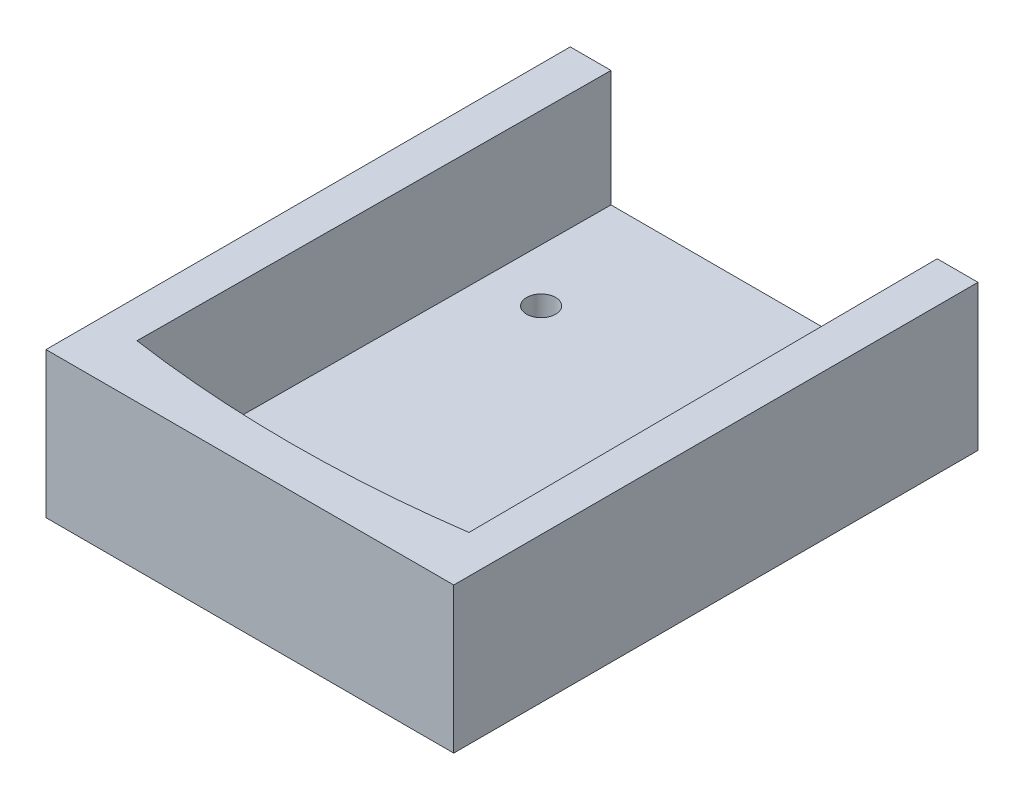
ISO-10303-21;
HEADER;
FILE_DESCRIPTION(('STEP AP214'),'2;1');
FILE_NAME('part.step','',(''),(''),'','','');
FILE_SCHEMA(('AUTOMOTIVE_DESIGN { 1 0 10303 214 1 1 1 1 }'));
ENDSEC;
DATA;
#1=APPLICATION_CONTEXT('core data for automotive mechanical design processes');
#2=APPLICATION_PROTOCOL_DEFINITION('international standard','automotive_design',2000,#1);
#3=PRODUCT_CONTEXT('',#1,'mechanical');
#4=PRODUCT('Part','Part','',(#3));
#5=PRODUCT_RELATED_PRODUCT_CATEGORY('part','',(#4));
#6=PRODUCT_DEFINITION_FORMATION('','',#4);
#7=PRODUCT_DEFINITION_CONTEXT('part definition',#1,'design');
#8=PRODUCT_DEFINITION('design','',#6,#7);
#9=PRODUCT_DEFINITION_SHAPE('','',#8);
#10=(LENGTH_UNIT() NAMED_UNIT(*) SI_UNIT(.MILLI.,.METRE.));
#11=(NAMED_UNIT(*) PLANE_ANGLE_UNIT() SI_UNIT($,.RADIAN.));
#12=(NAMED_UNIT(*) SI_UNIT($,.STERADIAN.) SOLID_ANGLE_UNIT());
#13=UNCERTAINTY_MEASURE_WITH_UNIT(LENGTH_MEASURE(1.E-05),#10,'distance_accuracy_value','');
#14=(GEOMETRIC_REPRESENTATION_CONTEXT(3) GLOBAL_UNCERTAINTY_ASSIGNED_CONTEXT((#13)) GLOBAL_UNIT_ASSIGNED_CONTEXT((#10,
#11,#12)) REPRESENTATION_CONTEXT('',''));
#15=CARTESIAN_POINT('',(0.,0.,0.));
#16=DIRECTION('',(0.,0.,1.));
#17=DIRECTION('',(1.,0.,0.));
#18=AXIS2_PLACEMENT_3D('',#15,#16,#17);
#19=CARTESIAN_POINT('',(70.,25.,0.));
#20=DIRECTION('',(0.,0.,-1.));
#21=DIRECTION('',(-1.,0.,0.));
#22=AXIS2_PLACEMENT_3D('',#19,#20,#21);
#23=PLANE('',#22);
#24=DIRECTION('',(1.,0.,0.));
#25=VECTOR('',#24,1.);
#26=CARTESIAN_POINT('',(70.,0.,0.));
#27=LINE('',#26,#25);
#28=CARTESIAN_POINT('',(0.,0.,0.));
#29=VERTEX_POINT('',#28);
#30=CARTESIAN_POINT('',(70.,0.,0.));
#31=VERTEX_POINT('',#30);
#32=EDGE_CURVE('E149',#29,#31,#27,.T.);
#33=ORIENTED_EDGE('',*,*,#32,.T.);
#34=DIRECTION('',(0.,-1.,0.));
#35=VECTOR('',#34,1.);
#36=CARTESIAN_POINT('',(70.,25.,0.));
#37=LINE('',#36,#35);
#38=CARTESIAN_POINT('',(70.,25.,0.));
#39=VERTEX_POINT('',#38);
#40=EDGE_CURVE('E12',#39,#31,#37,.T.);
#41=ORIENTED_EDGE('',*,*,#40,.F.);
#42=DIRECTION('',(1.,0.,0.));
#43=VECTOR('',#42,1.);
#44=CARTESIAN_POINT('',(70.,25.,0.));
#45=LINE('',#44,#43);
#46=CARTESIAN_POINT('',(0.,25.,0.));
#47=VERTEX_POINT('',#46);
#48=EDGE_CURVE('E153',#47,#39,#45,.T.);
#49=ORIENTED_EDGE('',*,*,#48,.F.);
#50=DIRECTION('',(0.,-1.,0.));
#51=VECTOR('',#50,1.);
#52=CARTESIAN_POINT('',(0.,25.,0.));
#53=LINE('',#52,#51);
#54=EDGE_CURVE('E161',#47,#29,#53,.T.);
#55=ORIENTED_EDGE('',*,*,#54,.T.);
#56=EDGE_LOOP('',(#33,#41,#49,#55));
#57=FACE_BOUND('',#56,.T.);
#58=ADVANCED_FACE('F41',(#57),#23,.F.);
#59=CARTESIAN_POINT('',(70.,25.,-90.));
#60=DIRECTION('',(-1.,0.,0.));
#61=DIRECTION('',(0.,0.,1.));
#62=AXIS2_PLACEMENT_3D('',#59,#60,#61);
#63=PLANE('',#62);
#64=DIRECTION('',(0.,0.,-1.));
#65=VECTOR('',#64,1.);
#66=CARTESIAN_POINT('',(70.,0.,-90.));
#67=LINE('',#66,#65);
#68=CARTESIAN_POINT('',(70.,0.,-90.));
#69=VERTEX_POINT('',#68);
#70=EDGE_CURVE('E164',#31,#69,#67,.T.);
#71=ORIENTED_EDGE('',*,*,#70,.T.);
#72=DIRECTION('',(0.,-1.,0.));
#73=VECTOR('',#72,1.);
#74=CARTESIAN_POINT('',(70.,25.,-90.));
#75=LINE('',#74,#73);
#76=CARTESIAN_POINT('',(70.,25.,-90.));
#77=VERTEX_POINT('',#76);
#78=EDGE_CURVE('E48',#77,#69,#75,.T.);
#79=ORIENTED_EDGE('',*,*,#78,.F.);
#80=DIRECTION('',(0.,0.,-1.));
#81=VECTOR('',#80,1.);
#82=CARTESIAN_POINT('',(70.,25.,-90.));
#83=LINE('',#82,#81);
#84=EDGE_CURVE('E92',#39,#77,#83,.T.);
#85=ORIENTED_EDGE('',*,*,#84,.F.);
#86=ORIENTED_EDGE('',*,*,#40,.T.);
#87=EDGE_LOOP('',(#71,#79,#85,#86));
#88=FACE_BOUND('',#87,.T.);
#89=ADVANCED_FACE('F200',(#88),#63,.F.);
#90=CARTESIAN_POINT('',(0.,25.,-90.));
#91=DIRECTION('',(0.,0.,1.));
#92=DIRECTION('',(1.,0.,0.));
#93=AXIS2_PLACEMENT_3D('',#90,#91,#92);
#94=PLANE('',#93);
#95=DIRECTION('',(-1.,0.,0.));
#96=VECTOR('',#95,1.);
#97=CARTESIAN_POINT('',(0.,25.,-90.));
#98=LINE('',#97,#96);
#99=CARTESIAN_POINT('',(7.,25.,-90.));
#100=VERTEX_POINT('',#99);
#101=CARTESIAN_POINT('',(0.,25.,-90.));
#102=VERTEX_POINT('',#101);
#103=EDGE_CURVE('E156',#100,#102,#98,.T.);
#104=ORIENTED_EDGE('',*,*,#103,.F.);
#105=DIRECTION('',(0.,1.,0.));
#106=VECTOR('',#105,1.);
#107=CARTESIAN_POINT('',(7.,5.,-90.));
#108=LINE('',#107,#106);
#109=CARTESIAN_POINT('',(7.,5.,-90.));
#110=VERTEX_POINT('',#109);
#111=EDGE_CURVE('E150',#110,#100,#108,.T.);
#112=ORIENTED_EDGE('',*,*,#111,.F.);
#113=DIRECTION('',(-1.,0.,0.));
#114=VECTOR('',#113,1.);
#115=CARTESIAN_POINT('',(63.,5.,-90.));
#116=LINE('',#115,#114);
#117=CARTESIAN_POINT('',(63.,5.,-90.));
#118=VERTEX_POINT('',#117);
#119=EDGE_CURVE('E129',#118,#110,#116,.T.);
#120=ORIENTED_EDGE('',*,*,#119,.F.);
#121=DIRECTION('',(0.,1.,0.));
#122=VECTOR('',#121,1.);
#123=CARTESIAN_POINT('',(63.,5.,-90.));
#124=LINE('',#123,#122);
#125=CARTESIAN_POINT('',(63.,25.,-90.));
#126=VERTEX_POINT('',#125);
#127=EDGE_CURVE('E120',#118,#126,#124,.T.);
#128=ORIENTED_EDGE('',*,*,#127,.T.);
#129=EDGE_CURVE('E157',#77,#126,#98,.T.);
#130=ORIENTED_EDGE('',*,*,#129,.F.);
#131=ORIENTED_EDGE('',*,*,#78,.T.);
#132=DIRECTION('',(-1.,0.,0.));
#133=VECTOR('',#132,1.);
#134=CARTESIAN_POINT('',(0.,0.,-90.));
#135=LINE('',#134,#133);
#136=CARTESIAN_POINT('',(0.,0.,-90.));
#137=VERTEX_POINT('',#136);
#138=EDGE_CURVE('E166',#69,#137,#135,.T.);
#139=ORIENTED_EDGE('',*,*,#138,.T.);
#140=DIRECTION('',(0.,-1.,0.));
#141=VECTOR('',#140,1.);
#142=CARTESIAN_POINT('',(0.,25.,-90.));
#143=LINE('',#142,#141);
#144=EDGE_CURVE('E170',#102,#137,#143,.T.);
#145=ORIENTED_EDGE('',*,*,#144,.F.);
#146=EDGE_LOOP('',(#104,#112,#120,#128,#130,#131,#139,#145));
#147=FACE_BOUND('',#146,.T.);
#148=ADVANCED_FACE('F176',(#147),#94,.F.);
#149=CARTESIAN_POINT('',(0.,25.,0.));
#150=DIRECTION('',(1.,0.,0.));
#151=DIRECTION('',(0.,0.,-1.));
#152=AXIS2_PLACEMENT_3D('',#149,#150,#151);
#153=PLANE('',#152);
#154=DIRECTION('',(0.,0.,1.));
#155=VECTOR('',#154,1.);
#156=CARTESIAN_POINT('',(0.,0.,0.));
#157=LINE('',#156,#155);
#158=EDGE_CURVE('E85',#137,#29,#157,.T.);
#159=ORIENTED_EDGE('',*,*,#158,.T.);
#160=ORIENTED_EDGE('',*,*,#54,.F.);
#161=DIRECTION('',(0.,0.,1.));
#162=VECTOR('',#161,1.);
#163=CARTESIAN_POINT('',(0.,25.,0.));
#164=LINE('',#163,#162);
#165=EDGE_CURVE('E64',#102,#47,#164,.T.);
#166=ORIENTED_EDGE('',*,*,#165,.F.);
#167=ORIENTED_EDGE('',*,*,#144,.T.);
#168=EDGE_LOOP('',(#159,#160,#166,#167));
#169=FACE_BOUND('',#168,.T.);
#170=ADVANCED_FACE('F184',(#169),#153,.F.);
#171=CARTESIAN_POINT('',(0.,25.,0.));
#172=DIRECTION('',(0.,-1.,0.));
#173=DIRECTION('',(0.,0.,-1.));
#174=AXIS2_PLACEMENT_3D('',#171,#172,#173);
#175=PLANE('',#174);
#176=CARTESIAN_POINT('',(35.,25.,-207.119974633089));
#177=DIRECTION('',(0.,1.,0.));
#178=DIRECTION('',(0.,0.,1.));
#179=AXIS2_PLACEMENT_3D('',#176,#177,#178);
#180=CIRCLE('',#179,200.040620874861);
#181=CARTESIAN_POINT('',(6.50000000000001,25.,-9.1199746330886));
#182=VERTEX_POINT('',#181);
#183=CARTESIAN_POINT('',(63.5,25.,-9.11997463308861));
#184=VERTEX_POINT('',#183);
#185=EDGE_CURVE('E55',#182,#184,#180,.T.);
#186=ORIENTED_EDGE('',*,*,#185,.F.);
#187=DIRECTION('',(-0.00618187795734159,0.,0.999980892009903));
#188=VECTOR('',#187,1.);
#189=CARTESIAN_POINT('',(6.50000000000001,25.,-9.1199746330886));
#190=LINE('',#189,#188);
#191=EDGE_CURVE('E133',#100,#182,#190,.T.);
#192=ORIENTED_EDGE('',*,*,#191,.F.);
#193=ORIENTED_EDGE('',*,*,#103,.T.);
#194=ORIENTED_EDGE('',*,*,#165,.T.);
#195=ORIENTED_EDGE('',*,*,#48,.T.);
#196=ORIENTED_EDGE('',*,*,#84,.T.);
#197=ORIENTED_EDGE('',*,*,#129,.T.);
#198=DIRECTION('',(-0.00618187795734193,0.,-0.999980892009903));
#199=VECTOR('',#198,1.);
#200=CARTESIAN_POINT('',(63.5,25.,-9.11997463308861));
#201=LINE('',#200,#199);
#202=EDGE_CURVE('E136',#184,#126,#201,.T.);
#203=ORIENTED_EDGE('',*,*,#202,.F.);
#204=EDGE_LOOP('',(#186,#192,#193,#194,#195,#196,#197,#203));
#205=FACE_BOUND('',#204,.T.);
#206=ADVANCED_FACE('F187',(#205),#175,.F.);
#207=CARTESIAN_POINT('',(0.,0.,0.));
#208=DIRECTION('',(0.,-1.,0.));
#209=DIRECTION('',(0.,0.,-1.));
#210=AXIS2_PLACEMENT_3D('',#207,#208,#209);
#211=PLANE('',#210);
#212=CARTESIAN_POINT('',(16.,0.,-69.));
#213=DIRECTION('',(0.,1.,0.));
#214=DIRECTION('',(0.,0.,1.));
#215=AXIS2_PLACEMENT_3D('',#212,#213,#214);
#216=CIRCLE('',#215,2.5);
#217=CARTESIAN_POINT('',(16.,0.,-66.5));
#218=VERTEX_POINT('',#217);
#219=EDGE_CURVE('E296',#218,#218,#216,.T.);
#220=ORIENTED_EDGE('',*,*,#219,.T.);
#221=EDGE_LOOP('',(#220));
#222=FACE_BOUND('',#221,.T.);
#223=CARTESIAN_POINT('',(50.,0.,-20.));
#224=DIRECTION('',(0.,1.,0.));
#225=DIRECTION('',(0.,0.,1.));
#226=AXIS2_PLACEMENT_3D('',#223,#224,#225);
#227=CIRCLE('',#226,2.49999999999999);
#228=CARTESIAN_POINT('',(50.,0.,-17.5));
#229=VERTEX_POINT('',#228);
#230=EDGE_CURVE('E300',#229,#229,#227,.T.);
#231=ORIENTED_EDGE('',*,*,#230,.T.);
#232=EDGE_LOOP('',(#231));
#233=FACE_BOUND('',#232,.T.);
#234=CARTESIAN_POINT('',(14.,0.,-23.));
#235=DIRECTION('',(0.,1.,0.));
#236=DIRECTION('',(0.,0.,1.));
#237=AXIS2_PLACEMENT_3D('',#234,#235,#236);
#238=CIRCLE('',#237,2.5);
#239=CARTESIAN_POINT('',(14.,0.,-20.5));
#240=VERTEX_POINT('',#239);
#241=EDGE_CURVE('E315',#240,#240,#238,.T.);
#242=ORIENTED_EDGE('',*,*,#241,.T.);
#243=EDGE_LOOP('',(#242));
#244=FACE_BOUND('',#243,.T.);
#245=CARTESIAN_POINT('',(50.3,0.,-70.));
#246=DIRECTION('',(0.,1.,0.));
#247=DIRECTION('',(0.,0.,1.));
#248=AXIS2_PLACEMENT_3D('',#245,#246,#247);
#249=CIRCLE('',#248,2.50000000000001);
#250=CARTESIAN_POINT('',(50.3,0.,-67.5));
#251=VERTEX_POINT('',#250);
#252=EDGE_CURVE('E145',#251,#251,#249,.T.);
#253=ORIENTED_EDGE('',*,*,#252,.T.);
#254=EDGE_LOOP('',(#253));
#255=FACE_BOUND('',#254,.T.);
#256=ORIENTED_EDGE('',*,*,#32,.F.);
#257=ORIENTED_EDGE('',*,*,#158,.F.);
#258=ORIENTED_EDGE('',*,*,#138,.F.);
#259=ORIENTED_EDGE('',*,*,#70,.F.);
#260=EDGE_LOOP('',(#256,#257,#258,#259));
#261=FACE_BOUND('',#260,.T.);
#262=ADVANCED_FACE('F180',(#222,#233,#244,#255,#261),#211,.T.);
#263=CARTESIAN_POINT('',(35.,5.,-207.119974633089));
#264=DIRECTION('',(0.,1.,0.));
#265=DIRECTION('',(0.,0.,1.));
#266=AXIS2_PLACEMENT_3D('',#263,#264,#265);
#267=CYLINDRICAL_SURFACE('',#266,200.040620874861);
#268=ORIENTED_EDGE('',*,*,#185,.T.);
#269=DIRECTION('',(0.,1.,0.));
#270=VECTOR('',#269,1.);
#271=CARTESIAN_POINT('',(63.5,5.,-9.11997463308861));
#272=LINE('',#271,#270);
#273=CARTESIAN_POINT('',(63.5,5.,-9.11997463308861));
#274=VERTEX_POINT('',#273);
#275=EDGE_CURVE('E112',#274,#184,#272,.T.);
#276=ORIENTED_EDGE('',*,*,#275,.F.);
#277=CARTESIAN_POINT('',(35.,5.,-207.119974633089));
#278=DIRECTION('',(0.,1.,0.));
#279=DIRECTION('',(0.,0.,1.));
#280=AXIS2_PLACEMENT_3D('',#277,#278,#279);
#281=CIRCLE('',#280,200.040620874861);
#282=CARTESIAN_POINT('',(6.50000000000001,5.,-9.1199746330886));
#283=VERTEX_POINT('',#282);
#284=EDGE_CURVE('E116',#283,#274,#281,.T.);
#285=ORIENTED_EDGE('',*,*,#284,.F.);
#286=DIRECTION('',(0.,1.,0.));
#287=VECTOR('',#286,1.);
#288=CARTESIAN_POINT('',(6.50000000000001,5.,-9.1199746330886));
#289=LINE('',#288,#287);
#290=EDGE_CURVE('E147',#283,#182,#289,.T.);
#291=ORIENTED_EDGE('',*,*,#290,.T.);
#292=EDGE_LOOP('',(#268,#276,#285,#291));
#293=FACE_BOUND('',#292,.T.);
#294=ADVANCED_FACE('F114',(#293),#267,.F.);
#295=CARTESIAN_POINT('',(6.50000000000001,5.,-9.1199746330886));
#296=DIRECTION('',(-0.999980892009903,0.,-0.00618187795734158));
#297=DIRECTION('',(-0.00618187795734158,0.,0.999980892009903));
#298=AXIS2_PLACEMENT_3D('',#295,#296,#297);
#299=PLANE('',#298);
#300=ORIENTED_EDGE('',*,*,#191,.T.);
#301=ORIENTED_EDGE('',*,*,#290,.F.);
#302=DIRECTION('',(-0.00618187795734159,0.,0.999980892009903));
#303=VECTOR('',#302,1.);
#304=CARTESIAN_POINT('',(6.50000000000001,5.,-9.1199746330886));
#305=LINE('',#304,#303);
#306=EDGE_CURVE('E121',#110,#283,#305,.T.);
#307=ORIENTED_EDGE('',*,*,#306,.F.);
#308=ORIENTED_EDGE('',*,*,#111,.T.);
#309=EDGE_LOOP('',(#300,#301,#307,#308));
#310=FACE_BOUND('',#309,.T.);
#311=ADVANCED_FACE('F189',(#310),#299,.F.);
#312=CARTESIAN_POINT('',(63.5,5.,-9.11997463308861));
#313=DIRECTION('',(0.999980892009903,0.,-0.00618187795734193));
#314=DIRECTION('',(-0.00618187795734193,0.,-0.999980892009903));
#315=AXIS2_PLACEMENT_3D('',#312,#313,#314);
#316=PLANE('',#315);
#317=ORIENTED_EDGE('',*,*,#202,.T.);
#318=ORIENTED_EDGE('',*,*,#127,.F.);
#319=DIRECTION('',(-0.00618187795734193,0.,-0.999980892009903));
#320=VECTOR('',#319,1.);
#321=CARTESIAN_POINT('',(63.5,5.,-9.11997463308861));
#322=LINE('',#321,#320);
#323=EDGE_CURVE('E124',#274,#118,#322,.T.);
#324=ORIENTED_EDGE('',*,*,#323,.F.);
#325=ORIENTED_EDGE('',*,*,#275,.T.);
#326=EDGE_LOOP('',(#317,#318,#324,#325));
#327=FACE_BOUND('',#326,.T.);
#328=ADVANCED_FACE('F125',(#327),#316,.F.);
#329=CARTESIAN_POINT('',(35.,5.,-207.119974633089));
#330=DIRECTION('',(0.,1.,0.));
#331=DIRECTION('',(0.,0.,1.));
#332=AXIS2_PLACEMENT_3D('',#329,#330,#331);
#333=PLANE('',#332);
#334=CARTESIAN_POINT('',(16.,5.,-69.));
#335=DIRECTION('',(0.,1.,0.));
#336=DIRECTION('',(0.,0.,1.));
#337=AXIS2_PLACEMENT_3D('',#334,#335,#336);
#338=CIRCLE('',#337,2.5);
#339=CARTESIAN_POINT('',(16.,5.,-66.5));
#340=VERTEX_POINT('',#339);
#341=EDGE_CURVE('E299',#340,#340,#338,.T.);
#342=ORIENTED_EDGE('',*,*,#341,.F.);
#343=EDGE_LOOP('',(#342));
#344=FACE_BOUND('',#343,.T.);
#345=CARTESIAN_POINT('',(50.,5.,-20.));
#346=DIRECTION('',(0.,1.,0.));
#347=DIRECTION('',(0.,0.,1.));
#348=AXIS2_PLACEMENT_3D('',#345,#346,#347);
#349=CIRCLE('',#348,2.49999999999999);
#350=CARTESIAN_POINT('',(50.,5.,-17.5));
#351=VERTEX_POINT('',#350);
#352=EDGE_CURVE('E303',#351,#351,#349,.T.);
#353=ORIENTED_EDGE('',*,*,#352,.F.);
#354=EDGE_LOOP('',(#353));
#355=FACE_BOUND('',#354,.T.);
#356=CARTESIAN_POINT('',(14.,5.,-23.));
#357=DIRECTION('',(0.,1.,0.));
#358=DIRECTION('',(0.,0.,1.));
#359=AXIS2_PLACEMENT_3D('',#356,#357,#358);
#360=CIRCLE('',#359,2.5);
#361=CARTESIAN_POINT('',(14.,5.,-20.5));
#362=VERTEX_POINT('',#361);
#363=EDGE_CURVE('E311',#362,#362,#360,.T.);
#364=ORIENTED_EDGE('',*,*,#363,.F.);
#365=EDGE_LOOP('',(#364));
#366=FACE_BOUND('',#365,.T.);
#367=CARTESIAN_POINT('',(50.3,5.,-70.));
#368=DIRECTION('',(0.,1.,0.));
#369=DIRECTION('',(0.,0.,1.));
#370=AXIS2_PLACEMENT_3D('',#367,#368,#369);
#371=CIRCLE('',#370,2.50000000000001);
#372=CARTESIAN_POINT('',(50.3,5.,-67.5));
#373=VERTEX_POINT('',#372);
#374=EDGE_CURVE('E139',#373,#373,#371,.T.);
#375=ORIENTED_EDGE('',*,*,#374,.F.);
#376=EDGE_LOOP('',(#375));
#377=FACE_BOUND('',#376,.T.);
#378=ORIENTED_EDGE('',*,*,#284,.T.);
#379=ORIENTED_EDGE('',*,*,#323,.T.);
#380=ORIENTED_EDGE('',*,*,#119,.T.);
#381=ORIENTED_EDGE('',*,*,#306,.T.);
#382=EDGE_LOOP('',(#378,#379,#380,#381));
#383=FACE_BOUND('',#382,.T.);
#384=ADVANCED_FACE('F131',(#344,#355,#366,#377,#383),#333,.T.);
#385=CARTESIAN_POINT('',(50.3,0.,-70.));
#386=DIRECTION('',(0.,1.,0.));
#387=DIRECTION('',(0.,0.,1.));
#388=AXIS2_PLACEMENT_3D('',#385,#386,#387);
#389=CYLINDRICAL_SURFACE('',#388,2.50000000000001);
#390=ORIENTED_EDGE('',*,*,#252,.F.);
#391=EDGE_LOOP('',(#390));
#392=FACE_BOUND('',#391,.T.);
#393=ORIENTED_EDGE('',*,*,#374,.T.);
#394=EDGE_LOOP('',(#393));
#395=FACE_BOUND('',#394,.T.);
#396=ADVANCED_FACE('F247',(#392,#395),#389,.F.);
#397=CARTESIAN_POINT('',(14.,0.,-23.));
#398=DIRECTION('',(0.,1.,0.));
#399=DIRECTION('',(0.,0.,1.));
#400=AXIS2_PLACEMENT_3D('',#397,#398,#399);
#401=CYLINDRICAL_SURFACE('',#400,2.5);
#402=ORIENTED_EDGE('',*,*,#241,.F.);
#403=EDGE_LOOP('',(#402));
#404=FACE_BOUND('',#403,.T.);
#405=ORIENTED_EDGE('',*,*,#363,.T.);
#406=EDGE_LOOP('',(#405));
#407=FACE_BOUND('',#406,.T.);
#408=ADVANCED_FACE('F253',(#404,#407),#401,.F.);
#409=CARTESIAN_POINT('',(50.,0.,-20.));
#410=DIRECTION('',(0.,1.,0.));
#411=DIRECTION('',(0.,0.,1.));
#412=AXIS2_PLACEMENT_3D('',#409,#410,#411);
#413=CYLINDRICAL_SURFACE('',#412,2.49999999999999);
#414=ORIENTED_EDGE('',*,*,#230,.F.);
#415=EDGE_LOOP('',(#414));
#416=FACE_BOUND('',#415,.T.);
#417=ORIENTED_EDGE('',*,*,#352,.T.);
#418=EDGE_LOOP('',(#417));
#419=FACE_BOUND('',#418,.T.);
#420=ADVANCED_FACE('F261',(#416,#419),#413,.F.);
#421=CARTESIAN_POINT('',(16.,0.,-69.));
#422=DIRECTION('',(0.,1.,0.));
#423=DIRECTION('',(0.,0.,1.));
#424=AXIS2_PLACEMENT_3D('',#421,#422,#423);
#425=CYLINDRICAL_SURFACE('',#424,2.5);
#426=ORIENTED_EDGE('',*,*,#219,.F.);
#427=EDGE_LOOP('',(#426));
#428=FACE_BOUND('',#427,.T.);
#429=ORIENTED_EDGE('',*,*,#341,.T.);
#430=EDGE_LOOP('',(#429));
#431=FACE_BOUND('',#430,.T.);
#432=ADVANCED_FACE('F269',(#428,#431),#425,.F.);
#433=CLOSED_SHELL('',(#58,#89,#148,#170,#206,#262,#294,#311,#328,#384,#396,#408,#420,#432));
#434=MANIFOLD_SOLID_BREP('B2',#433);
#435=ADVANCED_BREP_SHAPE_REPRESENTATION('',(#18,#434),#14);
#436=SHAPE_DEFINITION_REPRESENTATION(#9,#435);
ENDSEC;
END-ISO-10303-21;
